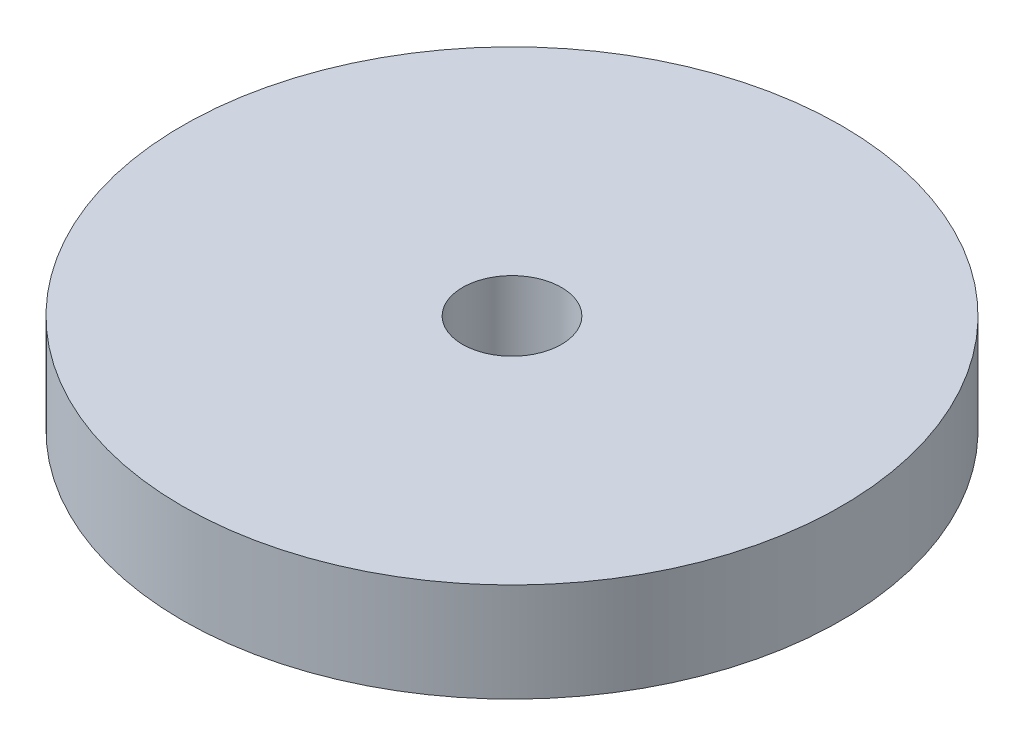
ISO-10303-21;
HEADER;
FILE_DESCRIPTION(('STEP AP214'),'2;1');
FILE_NAME('part.step','',(''),(''),'','','');
FILE_SCHEMA(('AUTOMOTIVE_DESIGN { 1 0 10303 214 1 1 1 1 }'));
ENDSEC;
DATA;
#1=APPLICATION_CONTEXT('core data for automotive mechanical design processes');
#2=APPLICATION_PROTOCOL_DEFINITION('international standard','automotive_design',2000,#1);
#3=PRODUCT_CONTEXT('',#1,'mechanical');
#4=PRODUCT('Part','Part','',(#3));
#5=PRODUCT_RELATED_PRODUCT_CATEGORY('part','',(#4));
#6=PRODUCT_DEFINITION_FORMATION('','',#4);
#7=PRODUCT_DEFINITION_CONTEXT('part definition',#1,'design');
#8=PRODUCT_DEFINITION('design','',#6,#7);
#9=PRODUCT_DEFINITION_SHAPE('','',#8);
#10=(LENGTH_UNIT() NAMED_UNIT(*) SI_UNIT(.MILLI.,.METRE.));
#11=(NAMED_UNIT(*) PLANE_ANGLE_UNIT() SI_UNIT($,.RADIAN.));
#12=(NAMED_UNIT(*) SI_UNIT($,.STERADIAN.) SOLID_ANGLE_UNIT());
#13=UNCERTAINTY_MEASURE_WITH_UNIT(LENGTH_MEASURE(1.E-05),#10,'distance_accuracy_value','');
#14=(GEOMETRIC_REPRESENTATION_CONTEXT(3) GLOBAL_UNCERTAINTY_ASSIGNED_CONTEXT((#13)) GLOBAL_UNIT_ASSIGNED_CONTEXT((#10,
#11,#12)) REPRESENTATION_CONTEXT('',''));
#15=CARTESIAN_POINT('',(0.,0.,0.));
#16=DIRECTION('',(0.,0.,1.));
#17=DIRECTION('',(1.,0.,0.));
#18=AXIS2_PLACEMENT_3D('',#15,#16,#17);
#19=CARTESIAN_POINT('',(0.,3.,0.));
#20=DIRECTION('',(0.,1.,0.));
#21=DIRECTION('',(0.,0.,1.));
#22=AXIS2_PLACEMENT_3D('',#19,#20,#21);
#23=PLANE('',#22);
#24=CARTESIAN_POINT('',(0.,3.,0.));
#25=DIRECTION('',(0.,1.,0.));
#26=DIRECTION('',(0.,0.,1.));
#27=AXIS2_PLACEMENT_3D('',#24,#25,#26);
#28=CIRCLE('',#27,10.);
#29=CARTESIAN_POINT('',(0.,3.,10.));
#30=VERTEX_POINT('',#29);
#31=EDGE_CURVE('E10',#30,#30,#28,.T.);
#32=ORIENTED_EDGE('',*,*,#31,.T.);
#33=EDGE_LOOP('',(#32));
#34=FACE_BOUND('',#33,.T.);
#35=CARTESIAN_POINT('',(0.,3.,0.));
#36=DIRECTION('',(0.,1.,0.));
#37=DIRECTION('',(0.,0.,1.));
#38=AXIS2_PLACEMENT_3D('',#35,#36,#37);
#39=CIRCLE('',#38,1.5);
#40=CARTESIAN_POINT('',(0.,3.,1.5));
#41=VERTEX_POINT('',#40);
#42=EDGE_CURVE('E42',#41,#41,#39,.T.);
#43=ORIENTED_EDGE('',*,*,#42,.F.);
#44=EDGE_LOOP('',(#43));
#45=FACE_BOUND('',#44,.T.);
#46=ADVANCED_FACE('F31',(#34,#45),#23,.T.);
#47=CARTESIAN_POINT('',(0.,0.,0.));
#48=DIRECTION('',(0.,1.,0.));
#49=DIRECTION('',(0.,0.,1.));
#50=AXIS2_PLACEMENT_3D('',#47,#48,#49);
#51=PLANE('',#50);
#52=CARTESIAN_POINT('',(0.,0.,0.));
#53=DIRECTION('',(0.,1.,0.));
#54=DIRECTION('',(0.,0.,1.));
#55=AXIS2_PLACEMENT_3D('',#52,#53,#54);
#56=CIRCLE('',#55,10.);
#57=CARTESIAN_POINT('',(0.,0.,10.));
#58=VERTEX_POINT('',#57);
#59=EDGE_CURVE('E35',#58,#58,#56,.T.);
#60=ORIENTED_EDGE('',*,*,#59,.F.);
#61=EDGE_LOOP('',(#60));
#62=FACE_BOUND('',#61,.T.);
#63=CARTESIAN_POINT('',(0.,0.,0.));
#64=DIRECTION('',(0.,1.,0.));
#65=DIRECTION('',(0.,0.,1.));
#66=AXIS2_PLACEMENT_3D('',#63,#64,#65);
#67=CIRCLE('',#66,1.5);
#68=CARTESIAN_POINT('',(0.,0.,1.5));
#69=VERTEX_POINT('',#68);
#70=EDGE_CURVE('E44',#69,#69,#67,.T.);
#71=ORIENTED_EDGE('',*,*,#70,.T.);
#72=EDGE_LOOP('',(#71));
#73=FACE_BOUND('',#72,.T.);
#74=ADVANCED_FACE('F54',(#62,#73),#51,.F.);
#75=CARTESIAN_POINT('',(0.,3.,0.));
#76=DIRECTION('',(0.,-1.,0.));
#77=DIRECTION('',(0.,0.,-1.));
#78=AXIS2_PLACEMENT_3D('',#75,#76,#77);
#79=CYLINDRICAL_SURFACE('',#78,10.);
#80=ORIENTED_EDGE('',*,*,#31,.F.);
#81=EDGE_LOOP('',(#80));
#82=FACE_BOUND('',#81,.T.);
#83=ORIENTED_EDGE('',*,*,#59,.T.);
#84=EDGE_LOOP('',(#83));
#85=FACE_BOUND('',#84,.T.);
#86=ADVANCED_FACE('F33',(#82,#85),#79,.T.);
#87=CARTESIAN_POINT('',(0.,3.,0.));
#88=DIRECTION('',(0.,-1.,0.));
#89=DIRECTION('',(0.,0.,-1.));
#90=AXIS2_PLACEMENT_3D('',#87,#88,#89);
#91=CYLINDRICAL_SURFACE('',#90,1.5);
#92=ORIENTED_EDGE('',*,*,#42,.T.);
#93=EDGE_LOOP('',(#92));
#94=FACE_BOUND('',#93,.T.);
#95=ORIENTED_EDGE('',*,*,#70,.F.);
#96=EDGE_LOOP('',(#95));
#97=FACE_BOUND('',#96,.T.);
#98=ADVANCED_FACE('F50',(#94,#97),#91,.F.);
#99=CLOSED_SHELL('',(#46,#74,#86,#98));
#100=MANIFOLD_SOLID_BREP('B2',#99);
#101=ADVANCED_BREP_SHAPE_REPRESENTATION('',(#18,#100),#14);
#102=SHAPE_DEFINITION_REPRESENTATION(#9,#101);
ENDSEC;
END-ISO-10303-21;
